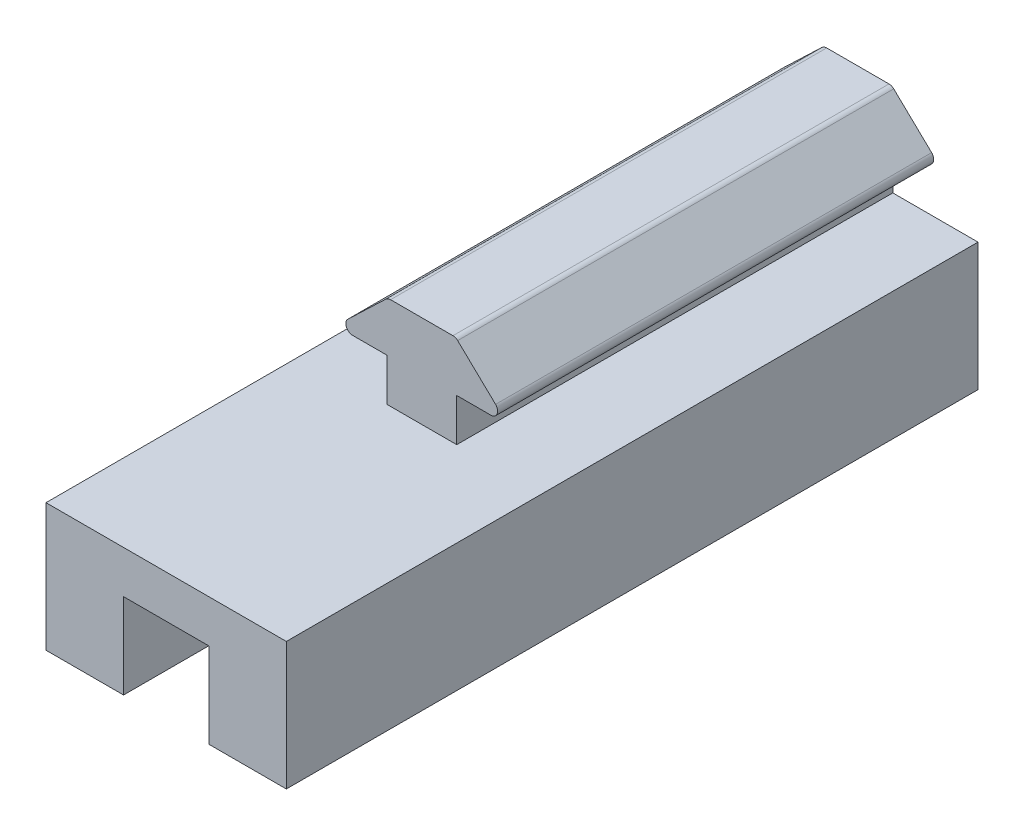
ISO-10303-21;
HEADER;
FILE_DESCRIPTION(('STEP AP214'),'2;1');
FILE_NAME('part.step','',(''),(''),'','','');
FILE_SCHEMA(('AUTOMOTIVE_DESIGN { 1 0 10303 214 1 1 1 1 }'));
ENDSEC;
DATA;
#1=APPLICATION_CONTEXT('core data for automotive mechanical design processes');
#2=APPLICATION_PROTOCOL_DEFINITION('international standard','automotive_design',2000,#1);
#3=PRODUCT_CONTEXT('',#1,'mechanical');
#4=PRODUCT('Part','Part','',(#3));
#5=PRODUCT_RELATED_PRODUCT_CATEGORY('part','',(#4));
#6=PRODUCT_DEFINITION_FORMATION('','',#4);
#7=PRODUCT_DEFINITION_CONTEXT('part definition',#1,'design');
#8=PRODUCT_DEFINITION('design','',#6,#7);
#9=PRODUCT_DEFINITION_SHAPE('','',#8);
#10=(LENGTH_UNIT() NAMED_UNIT(*) SI_UNIT(.MILLI.,.METRE.));
#11=(NAMED_UNIT(*) PLANE_ANGLE_UNIT() SI_UNIT($,.RADIAN.));
#12=(NAMED_UNIT(*) SI_UNIT($,.STERADIAN.) SOLID_ANGLE_UNIT());
#13=UNCERTAINTY_MEASURE_WITH_UNIT(LENGTH_MEASURE(1.E-05),#10,'distance_accuracy_value','');
#14=(GEOMETRIC_REPRESENTATION_CONTEXT(3) GLOBAL_UNCERTAINTY_ASSIGNED_CONTEXT((#13)) GLOBAL_UNIT_ASSIGNED_CONTEXT((#10,
#11,#12)) REPRESENTATION_CONTEXT('',''));
#15=CARTESIAN_POINT('',(0.,0.,0.));
#16=DIRECTION('',(0.,0.,1.));
#17=DIRECTION('',(1.,0.,0.));
#18=AXIS2_PLACEMENT_3D('',#15,#16,#17);
#19=CARTESIAN_POINT('',(-5.15005851846338,-9.98220009718977,0.));
#20=DIRECTION('',(0.,0.,1.));
#21=DIRECTION('',(1.,0.,0.));
#22=AXIS2_PLACEMENT_3D('',#19,#20,#21);
#23=PLANE('',#22);
#24=DIRECTION('',(0.,-1.,0.));
#25=VECTOR('',#24,1.);
#26=CARTESIAN_POINT('',(-2.60640832813196,-10.4902000971898,0.));
#27=LINE('',#26,#25);
#28=CARTESIAN_POINT('',(-2.60640832813196,-10.4902000971898,0.));
#29=VERTEX_POINT('',#28);
#30=CARTESIAN_POINT('',(-2.60640832813196,-13.6652000971898,0.));
#31=VERTEX_POINT('',#30);
#32=EDGE_CURVE('E196',#29,#31,#27,.T.);
#33=ORIENTED_EDGE('',*,*,#32,.T.);
#34=DIRECTION('',(1.,0.,0.));
#35=VECTOR('',#34,1.);
#36=CARTESIAN_POINT('',(-8.95640832813196,-13.6652000971898,0.));
#37=LINE('',#36,#35);
#38=CARTESIAN_POINT('',(2.60640832813195,-13.6652000971898,0.));
#39=VERTEX_POINT('',#38);
#40=EDGE_CURVE('E48',#31,#39,#37,.T.);
#41=ORIENTED_EDGE('',*,*,#40,.T.);
#42=DIRECTION('',(0.,1.,0.));
#43=VECTOR('',#42,1.);
#44=CARTESIAN_POINT('',(2.60640832813196,-10.4902000971898,0.));
#45=LINE('',#44,#43);
#46=CARTESIAN_POINT('',(2.60640832813196,-10.4902000971898,0.));
#47=VERTEX_POINT('',#46);
#48=EDGE_CURVE('E259',#39,#47,#45,.T.);
#49=ORIENTED_EDGE('',*,*,#48,.T.);
#50=DIRECTION('',(1.,0.,0.));
#51=VECTOR('',#50,1.);
#52=CARTESIAN_POINT('',(5.15005851893516,-10.4902000971898,0.));
#53=LINE('',#52,#51);
#54=CARTESIAN_POINT('',(5.15005851893516,-10.4902000971898,0.));
#55=VERTEX_POINT('',#54);
#56=EDGE_CURVE('E193',#47,#55,#53,.T.);
#57=ORIENTED_EDGE('',*,*,#56,.T.);
#58=CARTESIAN_POINT('',(5.15005851893516,-9.98220009718976,0.));
#59=DIRECTION('',(0.,0.,1.));
#60=DIRECTION('',(-1.,0.,0.));
#61=AXIS2_PLACEMENT_3D('',#58,#59,#60);
#62=CIRCLE('',#61,0.507999999999999);
#63=CARTESIAN_POINT('',(5.50113363539043,-9.61503492644788,0.));
#64=VERTEX_POINT('',#63);
#65=EDGE_CURVE('E255',#55,#64,#62,.T.);
#66=ORIENTED_EDGE('',*,*,#65,.T.);
#67=DIRECTION('',(-0.722766084137568,0.691092748927701,0.));
#68=VECTOR('',#67,1.);
#69=CARTESIAN_POINT('',(2.67523072433658,-6.91296982701346,0.));
#70=LINE('',#69,#68);
#71=CARTESIAN_POINT('',(2.67523072433658,-6.91296982701346,0.));
#72=VERTEX_POINT('',#71);
#73=EDGE_CURVE('E252',#64,#72,#70,.T.);
#74=ORIENTED_EDGE('',*,*,#73,.T.);
#75=CARTESIAN_POINT('',(2.3241556078813,-7.28013499775535,0.));
#76=DIRECTION('',(0.,0.,1.));
#77=DIRECTION('',(1.,0.,0.));
#78=AXIS2_PLACEMENT_3D('',#75,#76,#77);
#79=CIRCLE('',#78,0.507999999999999);
#80=CARTESIAN_POINT('',(2.3241556078813,-6.77213499775535,0.));
#81=VERTEX_POINT('',#80);
#82=EDGE_CURVE('E249',#72,#81,#79,.T.);
#83=ORIENTED_EDGE('',*,*,#82,.T.);
#84=DIRECTION('',(-1.,0.,0.));
#85=VECTOR('',#84,1.);
#86=CARTESIAN_POINT('',(-2.32415560595289,-6.77213499775535,0.));
#87=LINE('',#86,#85);
#88=CARTESIAN_POINT('',(-2.32415560595289,-6.77213499775535,0.));
#89=VERTEX_POINT('',#88);
#90=EDGE_CURVE('E246',#81,#89,#87,.T.);
#91=ORIENTED_EDGE('',*,*,#90,.T.);
#92=CARTESIAN_POINT('',(-2.32415560595289,-7.28013499775535,0.));
#93=DIRECTION('',(0.,0.,1.));
#94=DIRECTION('',(1.,0.,0.));
#95=AXIS2_PLACEMENT_3D('',#92,#93,#94);
#96=CIRCLE('',#95,0.508);
#97=CARTESIAN_POINT('',(-2.67523072231363,-6.91296982692307,0.));
#98=VERTEX_POINT('',#97);
#99=EDGE_CURVE('E243',#89,#98,#96,.T.);
#100=ORIENTED_EDGE('',*,*,#99,.T.);
#101=DIRECTION('',(-0.722766084315503,-0.69109274874161,0.));
#102=VECTOR('',#101,1.);
#103=CARTESIAN_POINT('',(-5.50113363482412,-9.61503492635749,0.));
#104=LINE('',#103,#102);
#105=CARTESIAN_POINT('',(-5.50113363482412,-9.61503492635749,0.));
#106=VERTEX_POINT('',#105);
#107=EDGE_CURVE('E240',#98,#106,#104,.T.);
#108=ORIENTED_EDGE('',*,*,#107,.T.);
#109=CARTESIAN_POINT('',(-5.15005851846338,-9.98220009718977,0.));
#110=DIRECTION('',(0.,0.,1.));
#111=DIRECTION('',(1.,0.,0.));
#112=AXIS2_PLACEMENT_3D('',#109,#110,#111);
#113=CIRCLE('',#112,0.508);
#114=CARTESIAN_POINT('',(-5.15005851846338,-10.4902000971898,0.));
#115=VERTEX_POINT('',#114);
#116=EDGE_CURVE('E237',#106,#115,#113,.T.);
#117=ORIENTED_EDGE('',*,*,#116,.T.);
#118=DIRECTION('',(1.,0.,0.));
#119=VECTOR('',#118,1.);
#120=CARTESIAN_POINT('',(-5.15005851846338,-10.4902000971898,0.));
#121=LINE('',#120,#119);
#122=EDGE_CURVE('E199',#115,#29,#121,.T.);
#123=ORIENTED_EDGE('',*,*,#122,.T.);
#124=EDGE_LOOP('',(#33,#41,#49,#57,#66,#74,#83,#91,#100,#108,#117,#123));
#125=FACE_BOUND('',#124,.T.);
#126=ADVANCED_FACE('F40',(#125),#23,.T.);
#127=CARTESIAN_POINT('',(2.60640832813196,-10.4902000971898,-292.1));
#128=DIRECTION('',(1.,0.,0.));
#129=DIRECTION('',(0.,1.,0.));
#130=AXIS2_PLACEMENT_3D('',#127,#128,#129);
#131=PLANE('',#130);
#132=DIRECTION('',(0.,-1.,0.));
#133=VECTOR('',#132,1.);
#134=CARTESIAN_POINT('',(2.60640832813196,-10.4902000971898,-32.5));
#135=LINE('',#134,#133);
#136=CARTESIAN_POINT('',(2.60640832813196,-10.4902000971898,-32.5));
#137=VERTEX_POINT('',#136);
#138=CARTESIAN_POINT('',(2.60640832813196,-13.6652000971898,-32.5));
#139=VERTEX_POINT('',#138);
#140=EDGE_CURVE('E177',#137,#139,#135,.T.);
#141=ORIENTED_EDGE('',*,*,#140,.F.);
#142=DIRECTION('',(0.,0.,1.));
#143=VECTOR('',#142,1.);
#144=CARTESIAN_POINT('',(2.60640832813196,-10.4902000971898,-292.1));
#145=LINE('',#144,#143);
#146=EDGE_CURVE('E185',#137,#47,#145,.T.);
#147=ORIENTED_EDGE('',*,*,#146,.T.);
#148=ORIENTED_EDGE('',*,*,#48,.F.);
#149=DIRECTION('',(0.,0.,1.));
#150=VECTOR('',#149,1.);
#151=CARTESIAN_POINT('',(2.60640832813196,-13.6652000971898,-292.1));
#152=LINE('',#151,#150);
#153=EDGE_CURVE('E187',#139,#39,#152,.T.);
#154=ORIENTED_EDGE('',*,*,#153,.F.);
#155=EDGE_LOOP('',(#141,#147,#148,#154));
#156=FACE_BOUND('',#155,.T.);
#157=ADVANCED_FACE('F42',(#156),#131,.T.);
#158=CARTESIAN_POINT('',(2.60640832813196,-13.6652000971898,-292.1));
#159=DIRECTION('',(0.,1.,0.));
#160=DIRECTION('',(0.,0.,1.));
#161=AXIS2_PLACEMENT_3D('',#158,#159,#160);
#162=PLANE('',#161);
#163=DIRECTION('',(1.,0.,0.));
#164=VECTOR('',#163,1.);
#165=CARTESIAN_POINT('',(2.60640832813196,-13.6652000971898,-32.5));
#166=LINE('',#165,#164);
#167=CARTESIAN_POINT('',(-8.95640832813196,-13.6652000971898,-32.5));
#168=VERTEX_POINT('',#167);
#169=CARTESIAN_POINT('',(-2.60640832813196,-13.6652000971898,-32.5));
#170=VERTEX_POINT('',#169);
#171=EDGE_CURVE('E189',#168,#170,#166,.T.);
#172=ORIENTED_EDGE('',*,*,#171,.F.);
#173=DIRECTION('',(0.,0.,1.));
#174=VECTOR('',#173,1.);
#175=CARTESIAN_POINT('',(-8.95640832813196,-13.6652000971898,-292.1));
#176=LINE('',#175,#174);
#177=CARTESIAN_POINT('',(-8.95640832813196,-13.6652000971898,19.05));
#178=VERTEX_POINT('',#177);
#179=EDGE_CURVE('E218',#168,#178,#176,.T.);
#180=ORIENTED_EDGE('',*,*,#179,.T.);
#181=DIRECTION('',(1.,0.,0.));
#182=VECTOR('',#181,1.);
#183=CARTESIAN_POINT('',(-8.95640832813196,-13.6652000971898,19.05));
#184=LINE('',#183,#182);
#185=CARTESIAN_POINT('',(8.95640832813196,-13.6652000971898,19.05));
#186=VERTEX_POINT('',#185);
#187=EDGE_CURVE('E278',#178,#186,#184,.T.);
#188=ORIENTED_EDGE('',*,*,#187,.T.);
#189=DIRECTION('',(0.,0.,1.));
#190=VECTOR('',#189,1.);
#191=CARTESIAN_POINT('',(8.95640832813196,-13.6652000971898,-292.1));
#192=LINE('',#191,#190);
#193=CARTESIAN_POINT('',(8.95640832813196,-13.6652000971898,-32.5));
#194=VERTEX_POINT('',#193);
#195=EDGE_CURVE('E232',#194,#186,#192,.T.);
#196=ORIENTED_EDGE('',*,*,#195,.F.);
#197=EDGE_CURVE('E287',#139,#194,#166,.T.);
#198=ORIENTED_EDGE('',*,*,#197,.F.);
#199=ORIENTED_EDGE('',*,*,#153,.T.);
#200=ORIENTED_EDGE('',*,*,#40,.F.);
#201=DIRECTION('',(0.,0.,1.));
#202=VECTOR('',#201,1.);
#203=CARTESIAN_POINT('',(-2.60640832813196,-13.6652000971898,-292.1));
#204=LINE('',#203,#202);
#205=EDGE_CURVE('E62',#170,#31,#204,.T.);
#206=ORIENTED_EDGE('',*,*,#205,.F.);
#207=EDGE_LOOP('',(#172,#180,#188,#196,#198,#199,#200,#206));
#208=FACE_BOUND('',#207,.T.);
#209=ADVANCED_FACE('F333',(#208),#162,.T.);
#210=CARTESIAN_POINT('',(8.95640832813196,-13.6652000971898,-292.1));
#211=DIRECTION('',(1.,0.,0.));
#212=DIRECTION('',(0.,0.,-1.));
#213=AXIS2_PLACEMENT_3D('',#210,#211,#212);
#214=PLANE('',#213);
#215=DIRECTION('',(0.,-1.,0.));
#216=VECTOR('',#215,1.);
#217=CARTESIAN_POINT('',(8.95640832813196,-13.6652000971898,-32.5));
#218=LINE('',#217,#216);
#219=CARTESIAN_POINT('',(8.95640832813196,-23.1902000971898,-32.5));
#220=VERTEX_POINT('',#219);
#221=EDGE_CURVE('E288',#194,#220,#218,.T.);
#222=ORIENTED_EDGE('',*,*,#221,.F.);
#223=ORIENTED_EDGE('',*,*,#195,.T.);
#224=DIRECTION('',(0.,-1.,0.));
#225=VECTOR('',#224,1.);
#226=CARTESIAN_POINT('',(8.95640832813196,-13.6652000971898,19.05));
#227=LINE('',#226,#225);
#228=CARTESIAN_POINT('',(8.95640832813196,-23.1902000971898,19.05));
#229=VERTEX_POINT('',#228);
#230=EDGE_CURVE('E275',#186,#229,#227,.T.);
#231=ORIENTED_EDGE('',*,*,#230,.T.);
#232=DIRECTION('',(0.,0.,1.));
#233=VECTOR('',#232,1.);
#234=CARTESIAN_POINT('',(8.95640832813196,-23.1902000971898,-292.1));
#235=LINE('',#234,#233);
#236=EDGE_CURVE('E230',#220,#229,#235,.T.);
#237=ORIENTED_EDGE('',*,*,#236,.F.);
#238=EDGE_LOOP('',(#222,#223,#231,#237));
#239=FACE_BOUND('',#238,.T.);
#240=ADVANCED_FACE('F339',(#239),#214,.T.);
#241=CARTESIAN_POINT('',(8.95640832813196,-23.1902000971898,-292.1));
#242=DIRECTION('',(0.,-1.,0.));
#243=DIRECTION('',(0.,0.,-1.));
#244=AXIS2_PLACEMENT_3D('',#241,#242,#243);
#245=PLANE('',#244);
#246=DIRECTION('',(-1.,0.,0.));
#247=VECTOR('',#246,1.);
#248=CARTESIAN_POINT('',(8.95640832813196,-23.1902000971898,-32.5));
#249=LINE('',#248,#247);
#250=CARTESIAN_POINT('',(3.175,-23.1902000971898,-32.5));
#251=VERTEX_POINT('',#250);
#252=EDGE_CURVE('E290',#220,#251,#249,.T.);
#253=ORIENTED_EDGE('',*,*,#252,.F.);
#254=ORIENTED_EDGE('',*,*,#236,.T.);
#255=DIRECTION('',(-1.,0.,0.));
#256=VECTOR('',#255,1.);
#257=CARTESIAN_POINT('',(8.95640832813196,-23.1902000971898,19.05));
#258=LINE('',#257,#256);
#259=CARTESIAN_POINT('',(3.175,-23.1902000971898,19.05));
#260=VERTEX_POINT('',#259);
#261=EDGE_CURVE('E272',#229,#260,#258,.T.);
#262=ORIENTED_EDGE('',*,*,#261,.T.);
#263=DIRECTION('',(0.,0.,1.));
#264=VECTOR('',#263,1.);
#265=CARTESIAN_POINT('',(3.175,-23.1902000971898,-292.1));
#266=LINE('',#265,#264);
#267=EDGE_CURVE('E228',#251,#260,#266,.T.);
#268=ORIENTED_EDGE('',*,*,#267,.F.);
#269=EDGE_LOOP('',(#253,#254,#262,#268));
#270=FACE_BOUND('',#269,.T.);
#271=ADVANCED_FACE('F343',(#270),#245,.T.);
#272=CARTESIAN_POINT('',(3.175,-16.8402000971898,-292.1));
#273=DIRECTION('',(-1.,0.,0.));
#274=DIRECTION('',(0.,0.,1.));
#275=AXIS2_PLACEMENT_3D('',#272,#273,#274);
#276=PLANE('',#275);
#277=DIRECTION('',(0.,1.,0.));
#278=VECTOR('',#277,1.);
#279=CARTESIAN_POINT('',(3.175,-16.8402000971898,-32.5));
#280=LINE('',#279,#278);
#281=CARTESIAN_POINT('',(3.175,-16.8402000971898,-32.5));
#282=VERTEX_POINT('',#281);
#283=EDGE_CURVE('E292',#251,#282,#280,.T.);
#284=ORIENTED_EDGE('',*,*,#283,.F.);
#285=ORIENTED_EDGE('',*,*,#267,.T.);
#286=DIRECTION('',(0.,1.,0.));
#287=VECTOR('',#286,1.);
#288=CARTESIAN_POINT('',(3.175,-23.1902000971898,19.05));
#289=LINE('',#288,#287);
#290=CARTESIAN_POINT('',(3.175,-16.8402000971898,19.05));
#291=VERTEX_POINT('',#290);
#292=EDGE_CURVE('E269',#260,#291,#289,.T.);
#293=ORIENTED_EDGE('',*,*,#292,.T.);
#294=DIRECTION('',(0.,0.,1.));
#295=VECTOR('',#294,1.);
#296=CARTESIAN_POINT('',(3.175,-16.8402000971898,-292.1));
#297=LINE('',#296,#295);
#298=EDGE_CURVE('E226',#282,#291,#297,.T.);
#299=ORIENTED_EDGE('',*,*,#298,.F.);
#300=EDGE_LOOP('',(#284,#285,#293,#299));
#301=FACE_BOUND('',#300,.T.);
#302=ADVANCED_FACE('F355',(#301),#276,.T.);
#303=CARTESIAN_POINT('',(-3.175,-16.8402000971898,-292.1));
#304=DIRECTION('',(0.,-1.,0.));
#305=DIRECTION('',(0.,0.,-1.));
#306=AXIS2_PLACEMENT_3D('',#303,#304,#305);
#307=PLANE('',#306);
#308=DIRECTION('',(-1.,0.,0.));
#309=VECTOR('',#308,1.);
#310=CARTESIAN_POINT('',(-3.175,-16.8402000971898,-32.5));
#311=LINE('',#310,#309);
#312=CARTESIAN_POINT('',(-3.175,-16.8402000971898,-32.5));
#313=VERTEX_POINT('',#312);
#314=EDGE_CURVE('E294',#282,#313,#311,.T.);
#315=ORIENTED_EDGE('',*,*,#314,.F.);
#316=ORIENTED_EDGE('',*,*,#298,.T.);
#317=DIRECTION('',(-1.,0.,0.));
#318=VECTOR('',#317,1.);
#319=CARTESIAN_POINT('',(3.175,-16.8402000971898,19.05));
#320=LINE('',#319,#318);
#321=CARTESIAN_POINT('',(-3.175,-16.8402000971898,19.05));
#322=VERTEX_POINT('',#321);
#323=EDGE_CURVE('E266',#291,#322,#320,.T.);
#324=ORIENTED_EDGE('',*,*,#323,.T.);
#325=DIRECTION('',(0.,0.,1.));
#326=VECTOR('',#325,1.);
#327=CARTESIAN_POINT('',(-3.175,-16.8402000971898,-292.1));
#328=LINE('',#327,#326);
#329=EDGE_CURVE('E224',#313,#322,#328,.T.);
#330=ORIENTED_EDGE('',*,*,#329,.F.);
#331=EDGE_LOOP('',(#315,#316,#324,#330));
#332=FACE_BOUND('',#331,.T.);
#333=ADVANCED_FACE('F360',(#332),#307,.T.);
#334=CARTESIAN_POINT('',(-3.175,-23.1902000971898,-292.1));
#335=DIRECTION('',(1.,0.,0.));
#336=DIRECTION('',(0.,0.,-1.));
#337=AXIS2_PLACEMENT_3D('',#334,#335,#336);
#338=PLANE('',#337);
#339=DIRECTION('',(0.,-1.,0.));
#340=VECTOR('',#339,1.);
#341=CARTESIAN_POINT('',(-3.175,-23.1902000971898,-32.5));
#342=LINE('',#341,#340);
#343=CARTESIAN_POINT('',(-3.175,-23.1902000971898,-32.5));
#344=VERTEX_POINT('',#343);
#345=EDGE_CURVE('E296',#313,#344,#342,.T.);
#346=ORIENTED_EDGE('',*,*,#345,.F.);
#347=ORIENTED_EDGE('',*,*,#329,.T.);
#348=DIRECTION('',(0.,-1.,0.));
#349=VECTOR('',#348,1.);
#350=CARTESIAN_POINT('',(-3.175,-16.8402000971898,19.05));
#351=LINE('',#350,#349);
#352=CARTESIAN_POINT('',(-3.175,-23.1902000971898,19.05));
#353=VERTEX_POINT('',#352);
#354=EDGE_CURVE('E261',#322,#353,#351,.T.);
#355=ORIENTED_EDGE('',*,*,#354,.T.);
#356=DIRECTION('',(0.,0.,1.));
#357=VECTOR('',#356,1.);
#358=CARTESIAN_POINT('',(-3.175,-23.1902000971898,-292.1));
#359=LINE('',#358,#357);
#360=EDGE_CURVE('E222',#344,#353,#359,.T.);
#361=ORIENTED_EDGE('',*,*,#360,.F.);
#362=EDGE_LOOP('',(#346,#347,#355,#361));
#363=FACE_BOUND('',#362,.T.);
#364=ADVANCED_FACE('F362',(#363),#338,.T.);
#365=CARTESIAN_POINT('',(-8.95640832813196,-23.1902000971898,-292.1));
#366=DIRECTION('',(0.,-1.,0.));
#367=DIRECTION('',(0.,0.,-1.));
#368=AXIS2_PLACEMENT_3D('',#365,#366,#367);
#369=PLANE('',#368);
#370=DIRECTION('',(-1.,0.,0.));
#371=VECTOR('',#370,1.);
#372=CARTESIAN_POINT('',(-8.95640832813196,-23.1902000971898,-32.5));
#373=LINE('',#372,#371);
#374=CARTESIAN_POINT('',(-8.95640832813196,-23.1902000971898,-32.5));
#375=VERTEX_POINT('',#374);
#376=EDGE_CURVE('E298',#344,#375,#373,.T.);
#377=ORIENTED_EDGE('',*,*,#376,.F.);
#378=ORIENTED_EDGE('',*,*,#360,.T.);
#379=DIRECTION('',(-1.,0.,0.));
#380=VECTOR('',#379,1.);
#381=CARTESIAN_POINT('',(-3.175,-23.1902000971898,19.05));
#382=LINE('',#381,#380);
#383=CARTESIAN_POINT('',(-8.95640832813196,-23.1902000971898,19.05));
#384=VERTEX_POINT('',#383);
#385=EDGE_CURVE('E284',#353,#384,#382,.T.);
#386=ORIENTED_EDGE('',*,*,#385,.T.);
#387=DIRECTION('',(0.,0.,1.));
#388=VECTOR('',#387,1.);
#389=CARTESIAN_POINT('',(-8.95640832813196,-23.1902000971898,-292.1));
#390=LINE('',#389,#388);
#391=EDGE_CURVE('E220',#375,#384,#390,.T.);
#392=ORIENTED_EDGE('',*,*,#391,.F.);
#393=EDGE_LOOP('',(#377,#378,#386,#392));
#394=FACE_BOUND('',#393,.T.);
#395=ADVANCED_FACE('F368',(#394),#369,.T.);
#396=CARTESIAN_POINT('',(-8.95640832813196,-13.6652000971898,-292.1));
#397=DIRECTION('',(-1.,0.,0.));
#398=DIRECTION('',(0.,-1.,0.));
#399=AXIS2_PLACEMENT_3D('',#396,#397,#398);
#400=PLANE('',#399);
#401=DIRECTION('',(0.,1.,0.));
#402=VECTOR('',#401,1.);
#403=CARTESIAN_POINT('',(-8.95640832813196,-13.6652000971898,-32.5));
#404=LINE('',#403,#402);
#405=EDGE_CURVE('E188',#375,#168,#404,.T.);
#406=ORIENTED_EDGE('',*,*,#405,.F.);
#407=ORIENTED_EDGE('',*,*,#391,.T.);
#408=DIRECTION('',(0.,1.,0.));
#409=VECTOR('',#408,1.);
#410=CARTESIAN_POINT('',(-8.95640832813196,-23.1902000971898,19.05));
#411=LINE('',#410,#409);
#412=EDGE_CURVE('E281',#384,#178,#411,.T.);
#413=ORIENTED_EDGE('',*,*,#412,.T.);
#414=ORIENTED_EDGE('',*,*,#179,.F.);
#415=EDGE_LOOP('',(#406,#407,#413,#414));
#416=FACE_BOUND('',#415,.T.);
#417=ADVANCED_FACE('F371',(#416),#400,.T.);
#418=CARTESIAN_POINT('',(-2.60640832813196,-10.4902000971898,-292.1));
#419=DIRECTION('',(-1.,0.,0.));
#420=DIRECTION('',(0.,-1.,0.));
#421=AXIS2_PLACEMENT_3D('',#418,#419,#420);
#422=PLANE('',#421);
#423=DIRECTION('',(0.,1.,0.));
#424=VECTOR('',#423,1.);
#425=CARTESIAN_POINT('',(-2.60640832813196,-10.4902000971898,-32.5));
#426=LINE('',#425,#424);
#427=CARTESIAN_POINT('',(-2.60640832813196,-10.4902000971898,-32.5));
#428=VERTEX_POINT('',#427);
#429=EDGE_CURVE('E302',#170,#428,#426,.T.);
#430=ORIENTED_EDGE('',*,*,#429,.F.);
#431=ORIENTED_EDGE('',*,*,#205,.T.);
#432=ORIENTED_EDGE('',*,*,#32,.F.);
#433=DIRECTION('',(0.,0.,1.));
#434=VECTOR('',#433,1.);
#435=CARTESIAN_POINT('',(-2.60640832813196,-10.4902000971898,-292.1));
#436=LINE('',#435,#434);
#437=EDGE_CURVE('E215',#428,#29,#436,.T.);
#438=ORIENTED_EDGE('',*,*,#437,.F.);
#439=EDGE_LOOP('',(#430,#431,#432,#438));
#440=FACE_BOUND('',#439,.T.);
#441=ADVANCED_FACE('F375',(#440),#422,.T.);
#442=CARTESIAN_POINT('',(-5.15005851846338,-10.4902000971898,-292.1));
#443=DIRECTION('',(0.,-1.,0.));
#444=DIRECTION('',(0.,0.,-1.));
#445=AXIS2_PLACEMENT_3D('',#442,#443,#444);
#446=PLANE('',#445);
#447=DIRECTION('',(-1.,0.,0.));
#448=VECTOR('',#447,1.);
#449=CARTESIAN_POINT('',(-5.15005851846338,-10.4902000971898,-32.5));
#450=LINE('',#449,#448);
#451=CARTESIAN_POINT('',(-5.15005851846338,-10.4902000971898,-32.5));
#452=VERTEX_POINT('',#451);
#453=EDGE_CURVE('E304',#428,#452,#450,.T.);
#454=ORIENTED_EDGE('',*,*,#453,.F.);
#455=ORIENTED_EDGE('',*,*,#437,.T.);
#456=ORIENTED_EDGE('',*,*,#122,.F.);
#457=DIRECTION('',(0.,0.,1.));
#458=VECTOR('',#457,1.);
#459=CARTESIAN_POINT('',(-5.15005851846338,-10.4902000971898,-292.1));
#460=LINE('',#459,#458);
#461=EDGE_CURVE('E213',#452,#115,#460,.T.);
#462=ORIENTED_EDGE('',*,*,#461,.F.);
#463=EDGE_LOOP('',(#454,#455,#456,#462));
#464=FACE_BOUND('',#463,.T.);
#465=ADVANCED_FACE('F378',(#464),#446,.T.);
#466=CARTESIAN_POINT('',(-5.15005851846338,-9.98220009718977,-292.1));
#467=DIRECTION('',(0.,0.,1.));
#468=DIRECTION('',(1.,0.,0.));
#469=AXIS2_PLACEMENT_3D('',#466,#467,#468);
#470=CYLINDRICAL_SURFACE('',#469,0.508);
#471=CARTESIAN_POINT('',(-5.15005851846338,-9.98220009718977,-32.5));
#472=DIRECTION('',(0.,0.,1.));
#473=DIRECTION('',(1.,0.,0.));
#474=AXIS2_PLACEMENT_3D('',#471,#472,#473);
#475=CIRCLE('',#474,0.508);
#476=CARTESIAN_POINT('',(-5.50113363482412,-9.61503492635749,-32.5));
#477=VERTEX_POINT('',#476);
#478=EDGE_CURVE('E306',#452,#477,#475,.F.);
#479=ORIENTED_EDGE('',*,*,#478,.F.);
#480=ORIENTED_EDGE('',*,*,#461,.T.);
#481=ORIENTED_EDGE('',*,*,#116,.F.);
#482=DIRECTION('',(0.,0.,1.));
#483=VECTOR('',#482,1.);
#484=CARTESIAN_POINT('',(-5.50113363482412,-9.61503492635749,-292.1));
#485=LINE('',#484,#483);
#486=EDGE_CURVE('E211',#477,#106,#485,.T.);
#487=ORIENTED_EDGE('',*,*,#486,.F.);
#488=EDGE_LOOP('',(#479,#480,#481,#487));
#489=FACE_BOUND('',#488,.T.);
#490=ADVANCED_FACE('F384',(#489),#470,.T.);
#491=CARTESIAN_POINT('',(-5.50113363482412,-9.61503492635749,-292.1));
#492=DIRECTION('',(-0.69109274874161,0.722766084315503,0.));
#493=DIRECTION('',(-0.722766084315503,-0.69109274874161,0.));
#494=AXIS2_PLACEMENT_3D('',#491,#492,#493);
#495=PLANE('',#494);
#496=DIRECTION('',(0.722766084315503,0.69109274874161,0.));
#497=VECTOR('',#496,1.);
#498=CARTESIAN_POINT('',(-5.50113363482412,-9.61503492635749,-32.5));
#499=LINE('',#498,#497);
#500=CARTESIAN_POINT('',(-2.67523072231363,-6.91296982692307,-32.5));
#501=VERTEX_POINT('',#500);
#502=EDGE_CURVE('E308',#477,#501,#499,.T.);
#503=ORIENTED_EDGE('',*,*,#502,.F.);
#504=ORIENTED_EDGE('',*,*,#486,.T.);
#505=ORIENTED_EDGE('',*,*,#107,.F.);
#506=DIRECTION('',(0.,0.,1.));
#507=VECTOR('',#506,1.);
#508=CARTESIAN_POINT('',(-2.67523072231363,-6.91296982692307,-292.1));
#509=LINE('',#508,#507);
#510=EDGE_CURVE('E209',#501,#98,#509,.T.);
#511=ORIENTED_EDGE('',*,*,#510,.F.);
#512=EDGE_LOOP('',(#503,#504,#505,#511));
#513=FACE_BOUND('',#512,.T.);
#514=ADVANCED_FACE('F388',(#513),#495,.T.);
#515=CARTESIAN_POINT('',(-2.32415560595289,-7.28013499775535,-292.1));
#516=DIRECTION('',(0.,0.,1.));
#517=DIRECTION('',(1.,0.,0.));
#518=AXIS2_PLACEMENT_3D('',#515,#516,#517);
#519=CYLINDRICAL_SURFACE('',#518,0.508);
#520=CARTESIAN_POINT('',(-2.32415560595289,-7.28013499775535,-32.5));
#521=DIRECTION('',(0.,0.,1.));
#522=DIRECTION('',(1.,0.,0.));
#523=AXIS2_PLACEMENT_3D('',#520,#521,#522);
#524=CIRCLE('',#523,0.508);
#525=CARTESIAN_POINT('',(-2.32415560595289,-6.77213499775535,-32.5));
#526=VERTEX_POINT('',#525);
#527=EDGE_CURVE('E310',#501,#526,#524,.F.);
#528=ORIENTED_EDGE('',*,*,#527,.F.);
#529=ORIENTED_EDGE('',*,*,#510,.T.);
#530=ORIENTED_EDGE('',*,*,#99,.F.);
#531=DIRECTION('',(0.,0.,1.));
#532=VECTOR('',#531,1.);
#533=CARTESIAN_POINT('',(-2.32415560595289,-6.77213499775535,-292.1));
#534=LINE('',#533,#532);
#535=EDGE_CURVE('E207',#526,#89,#534,.T.);
#536=ORIENTED_EDGE('',*,*,#535,.F.);
#537=EDGE_LOOP('',(#528,#529,#530,#536));
#538=FACE_BOUND('',#537,.T.);
#539=ADVANCED_FACE('F394',(#538),#519,.T.);
#540=CARTESIAN_POINT('',(-2.32415560595289,-6.77213499775535,-292.1));
#541=DIRECTION('',(0.,1.,0.));
#542=DIRECTION('',(-1.,0.,0.));
#543=AXIS2_PLACEMENT_3D('',#540,#541,#542);
#544=PLANE('',#543);
#545=DIRECTION('',(1.,0.,0.));
#546=VECTOR('',#545,1.);
#547=CARTESIAN_POINT('',(-2.32415560595289,-6.77213499775535,-32.5));
#548=LINE('',#547,#546);
#549=CARTESIAN_POINT('',(2.3241556078813,-6.77213499775535,-32.5));
#550=VERTEX_POINT('',#549);
#551=EDGE_CURVE('E312',#526,#550,#548,.T.);
#552=ORIENTED_EDGE('',*,*,#551,.F.);
#553=ORIENTED_EDGE('',*,*,#535,.T.);
#554=ORIENTED_EDGE('',*,*,#90,.F.);
#555=DIRECTION('',(0.,0.,1.));
#556=VECTOR('',#555,1.);
#557=CARTESIAN_POINT('',(2.3241556078813,-6.77213499775535,-292.1));
#558=LINE('',#557,#556);
#559=EDGE_CURVE('E205',#550,#81,#558,.T.);
#560=ORIENTED_EDGE('',*,*,#559,.F.);
#561=EDGE_LOOP('',(#552,#553,#554,#560));
#562=FACE_BOUND('',#561,.T.);
#563=ADVANCED_FACE('F398',(#562),#544,.T.);
#564=CARTESIAN_POINT('',(2.3241556078813,-7.28013499775535,-292.1));
#565=DIRECTION('',(0.,0.,1.));
#566=DIRECTION('',(1.,0.,0.));
#567=AXIS2_PLACEMENT_3D('',#564,#565,#566);
#568=CYLINDRICAL_SURFACE('',#567,0.507999999999999);
#569=CARTESIAN_POINT('',(2.3241556078813,-7.28013499775535,-32.5));
#570=DIRECTION('',(0.,0.,1.));
#571=DIRECTION('',(1.,0.,0.));
#572=AXIS2_PLACEMENT_3D('',#569,#570,#571);
#573=CIRCLE('',#572,0.507999999999999);
#574=CARTESIAN_POINT('',(2.67523072433658,-6.91296982701346,-32.5));
#575=VERTEX_POINT('',#574);
#576=EDGE_CURVE('E314',#550,#575,#573,.F.);
#577=ORIENTED_EDGE('',*,*,#576,.F.);
#578=ORIENTED_EDGE('',*,*,#559,.T.);
#579=ORIENTED_EDGE('',*,*,#82,.F.);
#580=DIRECTION('',(0.,0.,1.));
#581=VECTOR('',#580,1.);
#582=CARTESIAN_POINT('',(2.67523072433658,-6.91296982701346,-292.1));
#583=LINE('',#582,#581);
#584=EDGE_CURVE('E203',#575,#72,#583,.T.);
#585=ORIENTED_EDGE('',*,*,#584,.F.);
#586=EDGE_LOOP('',(#577,#578,#579,#585));
#587=FACE_BOUND('',#586,.T.);
#588=ADVANCED_FACE('F401',(#587),#568,.T.);
#589=CARTESIAN_POINT('',(2.67523072433658,-6.91296982701346,-292.1));
#590=DIRECTION('',(0.691092748927701,0.722766084137568,0.));
#591=DIRECTION('',(-0.722766084137568,0.691092748927701,0.));
#592=AXIS2_PLACEMENT_3D('',#589,#590,#591);
#593=PLANE('',#592);
#594=DIRECTION('',(0.722766084137568,-0.691092748927701,0.));
#595=VECTOR('',#594,1.);
#596=CARTESIAN_POINT('',(2.67523072433658,-6.91296982701346,-32.5));
#597=LINE('',#596,#595);
#598=CARTESIAN_POINT('',(5.50113363539043,-9.61503492644788,-32.5));
#599=VERTEX_POINT('',#598);
#600=EDGE_CURVE('E316',#575,#599,#597,.T.);
#601=ORIENTED_EDGE('',*,*,#600,.F.);
#602=ORIENTED_EDGE('',*,*,#584,.T.);
#603=ORIENTED_EDGE('',*,*,#73,.F.);
#604=DIRECTION('',(0.,0.,1.));
#605=VECTOR('',#604,1.);
#606=CARTESIAN_POINT('',(5.50113363539043,-9.61503492644788,-292.1));
#607=LINE('',#606,#605);
#608=EDGE_CURVE('E197',#599,#64,#607,.T.);
#609=ORIENTED_EDGE('',*,*,#608,.F.);
#610=EDGE_LOOP('',(#601,#602,#603,#609));
#611=FACE_BOUND('',#610,.T.);
#612=ADVANCED_FACE('F327',(#611),#593,.T.);
#613=CARTESIAN_POINT('',(5.15005851893516,-9.98220009718976,-292.1));
#614=DIRECTION('',(0.,0.,1.));
#615=DIRECTION('',(1.,0.,0.));
#616=AXIS2_PLACEMENT_3D('',#613,#614,#615);
#617=CYLINDRICAL_SURFACE('',#616,0.507999999999999);
#618=CARTESIAN_POINT('',(5.15005851893516,-9.98220009718976,-32.5));
#619=DIRECTION('',(0.,0.,1.));
#620=DIRECTION('',(1.,0.,0.));
#621=AXIS2_PLACEMENT_3D('',#618,#619,#620);
#622=CIRCLE('',#621,0.507999999999999);
#623=CARTESIAN_POINT('',(5.15005851893516,-10.4902000971898,-32.5));
#624=VERTEX_POINT('',#623);
#625=EDGE_CURVE('E54',#599,#624,#622,.F.);
#626=ORIENTED_EDGE('',*,*,#625,.F.);
#627=ORIENTED_EDGE('',*,*,#608,.T.);
#628=ORIENTED_EDGE('',*,*,#65,.F.);
#629=DIRECTION('',(0.,0.,1.));
#630=VECTOR('',#629,1.);
#631=CARTESIAN_POINT('',(5.15005851893516,-10.4902000971898,-292.1));
#632=LINE('',#631,#630);
#633=EDGE_CURVE('E195',#624,#55,#632,.T.);
#634=ORIENTED_EDGE('',*,*,#633,.F.);
#635=EDGE_LOOP('',(#626,#627,#628,#634));
#636=FACE_BOUND('',#635,.T.);
#637=ADVANCED_FACE('F324',(#636),#617,.T.);
#638=CARTESIAN_POINT('',(5.15005851893516,-10.4902000971898,-292.1));
#639=DIRECTION('',(0.,-1.,0.));
#640=DIRECTION('',(1.,0.,0.));
#641=AXIS2_PLACEMENT_3D('',#638,#639,#640);
#642=PLANE('',#641);
#643=DIRECTION('',(-1.,0.,0.));
#644=VECTOR('',#643,1.);
#645=CARTESIAN_POINT('',(5.15005851893516,-10.4902000971898,-32.5));
#646=LINE('',#645,#644);
#647=EDGE_CURVE('E12',#624,#137,#646,.T.);
#648=ORIENTED_EDGE('',*,*,#647,.F.);
#649=ORIENTED_EDGE('',*,*,#633,.T.);
#650=ORIENTED_EDGE('',*,*,#56,.F.);
#651=ORIENTED_EDGE('',*,*,#146,.F.);
#652=EDGE_LOOP('',(#648,#649,#650,#651));
#653=FACE_BOUND('',#652,.T.);
#654=ADVANCED_FACE('F191',(#653),#642,.T.);
#655=CARTESIAN_POINT('',(0.,0.,19.05));
#656=DIRECTION('',(0.,0.,-1.));
#657=DIRECTION('',(-1.,0.,0.));
#658=AXIS2_PLACEMENT_3D('',#655,#656,#657);
#659=PLANE('',#658);
#660=ORIENTED_EDGE('',*,*,#385,.F.);
#661=ORIENTED_EDGE('',*,*,#354,.F.);
#662=ORIENTED_EDGE('',*,*,#323,.F.);
#663=ORIENTED_EDGE('',*,*,#292,.F.);
#664=ORIENTED_EDGE('',*,*,#261,.F.);
#665=ORIENTED_EDGE('',*,*,#230,.F.);
#666=ORIENTED_EDGE('',*,*,#187,.F.);
#667=ORIENTED_EDGE('',*,*,#412,.F.);
#668=EDGE_LOOP('',(#660,#661,#662,#663,#664,#665,#666,#667));
#669=FACE_BOUND('',#668,.T.);
#670=ADVANCED_FACE('F348',(#669),#659,.F.);
#671=CARTESIAN_POINT('',(-20.,3.22786500224466,-32.5));
#672=DIRECTION('',(0.,0.,1.));
#673=DIRECTION('',(1.,0.,0.));
#674=AXIS2_PLACEMENT_3D('',#671,#672,#673);
#675=PLANE('',#674);
#676=ORIENTED_EDGE('',*,*,#197,.T.);
#677=ORIENTED_EDGE('',*,*,#221,.T.);
#678=ORIENTED_EDGE('',*,*,#252,.T.);
#679=ORIENTED_EDGE('',*,*,#283,.T.);
#680=ORIENTED_EDGE('',*,*,#314,.T.);
#681=ORIENTED_EDGE('',*,*,#345,.T.);
#682=ORIENTED_EDGE('',*,*,#376,.T.);
#683=ORIENTED_EDGE('',*,*,#405,.T.);
#684=ORIENTED_EDGE('',*,*,#171,.T.);
#685=ORIENTED_EDGE('',*,*,#429,.T.);
#686=ORIENTED_EDGE('',*,*,#453,.T.);
#687=ORIENTED_EDGE('',*,*,#478,.T.);
#688=ORIENTED_EDGE('',*,*,#502,.T.);
#689=ORIENTED_EDGE('',*,*,#527,.T.);
#690=ORIENTED_EDGE('',*,*,#551,.T.);
#691=ORIENTED_EDGE('',*,*,#576,.T.);
#692=ORIENTED_EDGE('',*,*,#600,.T.);
#693=ORIENTED_EDGE('',*,*,#625,.T.);
#694=ORIENTED_EDGE('',*,*,#647,.T.);
#695=ORIENTED_EDGE('',*,*,#140,.T.);
#696=EDGE_LOOP('',(#676,#677,#678,#679,#680,#681,#682,#683,#684,#685,#686,#687,#688,#689,#690,
#691,#692,#693,#694,#695));
#697=FACE_BOUND('',#696,.T.);
#698=ADVANCED_FACE('F176',(#697),#675,.F.);
#699=CLOSED_SHELL('',(#126,#157,#209,#240,#271,#302,#333,#364,#395,#417,#441,#465,#490,#514,
#539,#563,#588,#612,#637,#654,#670,#698));
#700=MANIFOLD_SOLID_BREP('B2',#699);
#701=ADVANCED_BREP_SHAPE_REPRESENTATION('',(#18,#700),#14);
#702=SHAPE_DEFINITION_REPRESENTATION(#9,#701);
ENDSEC;
END-ISO-10303-21;
